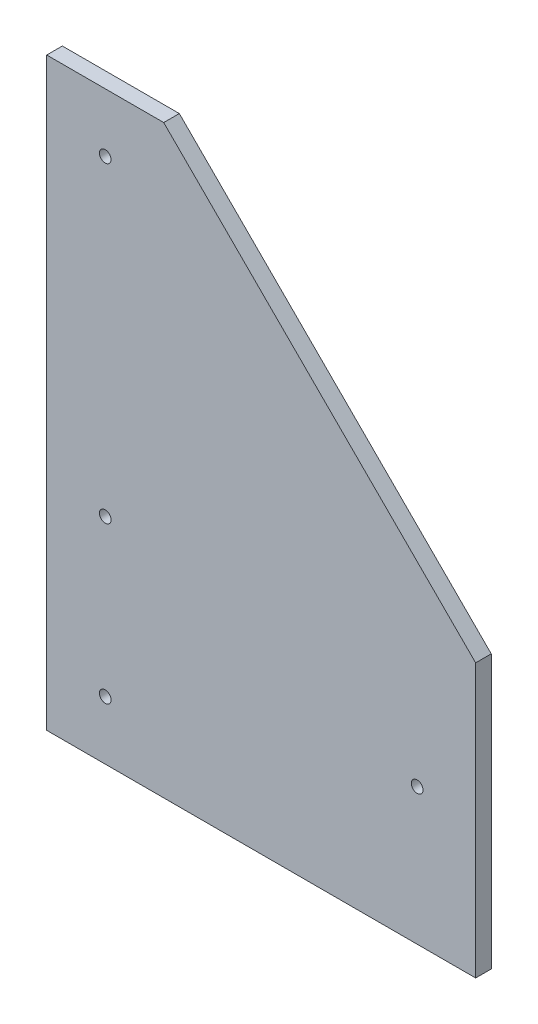
ISO-10303-21;
HEADER;
FILE_DESCRIPTION(('STEP AP214'),'2;1');
FILE_NAME('part.step','',(''),(''),'','','');
FILE_SCHEMA(('AUTOMOTIVE_DESIGN { 1 0 10303 214 1 1 1 1 }'));
ENDSEC;
DATA;
#1=APPLICATION_CONTEXT('core data for automotive mechanical design processes');
#2=APPLICATION_PROTOCOL_DEFINITION('international standard','automotive_design',2000,#1);
#3=PRODUCT_CONTEXT('',#1,'mechanical');
#4=PRODUCT('Part','Part','',(#3));
#5=PRODUCT_RELATED_PRODUCT_CATEGORY('part','',(#4));
#6=PRODUCT_DEFINITION_FORMATION('','',#4);
#7=PRODUCT_DEFINITION_CONTEXT('part definition',#1,'design');
#8=PRODUCT_DEFINITION('design','',#6,#7);
#9=PRODUCT_DEFINITION_SHAPE('','',#8);
#10=(LENGTH_UNIT() NAMED_UNIT(*) SI_UNIT(.MILLI.,.METRE.));
#11=(NAMED_UNIT(*) PLANE_ANGLE_UNIT() SI_UNIT($,.RADIAN.));
#12=(NAMED_UNIT(*) SI_UNIT($,.STERADIAN.) SOLID_ANGLE_UNIT());
#13=UNCERTAINTY_MEASURE_WITH_UNIT(LENGTH_MEASURE(1.E-05),#10,'distance_accuracy_value','');
#14=(GEOMETRIC_REPRESENTATION_CONTEXT(3) GLOBAL_UNCERTAINTY_ASSIGNED_CONTEXT((#13)) GLOBAL_UNIT_ASSIGNED_CONTEXT((#10,
#11,#12)) REPRESENTATION_CONTEXT('',''));
#15=CARTESIAN_POINT('',(0.,0.,0.));
#16=DIRECTION('',(0.,0.,1.));
#17=DIRECTION('',(1.,0.,0.));
#18=AXIS2_PLACEMENT_3D('',#15,#16,#17);
#19=CARTESIAN_POINT('',(0.,190.5,5.08));
#20=DIRECTION('',(1.,0.,0.));
#21=DIRECTION('',(0.,1.,0.));
#22=AXIS2_PLACEMENT_3D('',#19,#20,#21);
#23=PLANE('',#22);
#24=DIRECTION('',(0.,-1.,0.));
#25=VECTOR('',#24,1.);
#26=CARTESIAN_POINT('',(0.,190.5,0.));
#27=LINE('',#26,#25);
#28=CARTESIAN_POINT('',(0.,190.5,0.));
#29=VERTEX_POINT('',#28);
#30=CARTESIAN_POINT('',(0.,0.,0.));
#31=VERTEX_POINT('',#30);
#32=EDGE_CURVE('E107',#29,#31,#27,.T.);
#33=ORIENTED_EDGE('',*,*,#32,.T.);
#34=DIRECTION('',(0.,0.,-1.));
#35=VECTOR('',#34,1.);
#36=CARTESIAN_POINT('',(0.,0.,5.08));
#37=LINE('',#36,#35);
#38=CARTESIAN_POINT('',(0.,0.,5.08));
#39=VERTEX_POINT('',#38);
#40=EDGE_CURVE('E11',#39,#31,#37,.T.);
#41=ORIENTED_EDGE('',*,*,#40,.F.);
#42=DIRECTION('',(0.,-1.,0.));
#43=VECTOR('',#42,1.);
#44=CARTESIAN_POINT('',(0.,190.5,5.08));
#45=LINE('',#44,#43);
#46=CARTESIAN_POINT('',(0.,190.5,5.08));
#47=VERTEX_POINT('',#46);
#48=EDGE_CURVE('E116',#47,#39,#45,.T.);
#49=ORIENTED_EDGE('',*,*,#48,.F.);
#50=DIRECTION('',(0.,0.,-1.));
#51=VECTOR('',#50,1.);
#52=CARTESIAN_POINT('',(0.,190.5,5.08));
#53=LINE('',#52,#51);
#54=EDGE_CURVE('E103',#47,#29,#53,.T.);
#55=ORIENTED_EDGE('',*,*,#54,.T.);
#56=EDGE_LOOP('',(#33,#41,#49,#55));
#57=FACE_BOUND('',#56,.T.);
#58=ADVANCED_FACE('F33',(#57),#23,.F.);
#59=CARTESIAN_POINT('',(0.,0.,5.08));
#60=DIRECTION('',(0.,1.,0.));
#61=DIRECTION('',(0.,0.,1.));
#62=AXIS2_PLACEMENT_3D('',#59,#60,#61);
#63=PLANE('',#62);
#64=DIRECTION('',(1.,0.,0.));
#65=VECTOR('',#64,1.);
#66=CARTESIAN_POINT('',(0.,0.,0.));
#67=LINE('',#66,#65);
#68=CARTESIAN_POINT('',(139.7,0.,0.));
#69=VERTEX_POINT('',#68);
#70=EDGE_CURVE('E110',#31,#69,#67,.T.);
#71=ORIENTED_EDGE('',*,*,#70,.T.);
#72=DIRECTION('',(0.,0.,-1.));
#73=VECTOR('',#72,1.);
#74=CARTESIAN_POINT('',(139.7,0.,5.08));
#75=LINE('',#74,#73);
#76=CARTESIAN_POINT('',(139.7,0.,5.08));
#77=VERTEX_POINT('',#76);
#78=EDGE_CURVE('E41',#77,#69,#75,.T.);
#79=ORIENTED_EDGE('',*,*,#78,.F.);
#80=DIRECTION('',(1.,0.,0.));
#81=VECTOR('',#80,1.);
#82=CARTESIAN_POINT('',(0.,0.,5.08));
#83=LINE('',#82,#81);
#84=EDGE_CURVE('E83',#39,#77,#83,.T.);
#85=ORIENTED_EDGE('',*,*,#84,.F.);
#86=ORIENTED_EDGE('',*,*,#40,.T.);
#87=EDGE_LOOP('',(#71,#79,#85,#86));
#88=FACE_BOUND('',#87,.T.);
#89=ADVANCED_FACE('F136',(#88),#63,.F.);
#90=CARTESIAN_POINT('',(139.7,0.,5.08));
#91=DIRECTION('',(-1.,0.,0.));
#92=DIRECTION('',(0.,-1.,0.));
#93=AXIS2_PLACEMENT_3D('',#90,#91,#92);
#94=PLANE('',#93);
#95=DIRECTION('',(0.,1.,0.));
#96=VECTOR('',#95,1.);
#97=CARTESIAN_POINT('',(139.7,0.,0.));
#98=LINE('',#97,#96);
#99=CARTESIAN_POINT('',(139.7,88.9,0.));
#100=VERTEX_POINT('',#99);
#101=EDGE_CURVE('E98',#69,#100,#98,.T.);
#102=ORIENTED_EDGE('',*,*,#101,.T.);
#103=DIRECTION('',(0.,0.,-1.));
#104=VECTOR('',#103,1.);
#105=CARTESIAN_POINT('',(139.7,88.9,5.08));
#106=LINE('',#105,#104);
#107=CARTESIAN_POINT('',(139.7,88.9,5.08));
#108=VERTEX_POINT('',#107);
#109=EDGE_CURVE('E95',#108,#100,#106,.T.);
#110=ORIENTED_EDGE('',*,*,#109,.F.);
#111=DIRECTION('',(0.,1.,0.));
#112=VECTOR('',#111,1.);
#113=CARTESIAN_POINT('',(139.7,0.,5.08));
#114=LINE('',#113,#112);
#115=EDGE_CURVE('E87',#77,#108,#114,.T.);
#116=ORIENTED_EDGE('',*,*,#115,.F.);
#117=ORIENTED_EDGE('',*,*,#78,.T.);
#118=EDGE_LOOP('',(#102,#110,#116,#117));
#119=FACE_BOUND('',#118,.T.);
#120=ADVANCED_FACE('F96',(#119),#94,.F.);
#121=CARTESIAN_POINT('',(139.7,88.9,5.08));
#122=DIRECTION('',(-0.707106781186547,-0.707106781186548,0.));
#123=DIRECTION('',(0.707106781186548,-0.707106781186547,0.));
#124=AXIS2_PLACEMENT_3D('',#121,#122,#123);
#125=PLANE('',#124);
#126=DIRECTION('',(-0.707106781186548,0.707106781186547,0.));
#127=VECTOR('',#126,1.);
#128=CARTESIAN_POINT('',(139.7,88.9,0.));
#129=LINE('',#128,#127);
#130=CARTESIAN_POINT('',(38.1,190.5,0.));
#131=VERTEX_POINT('',#130);
#132=EDGE_CURVE('E69',#100,#131,#129,.T.);
#133=ORIENTED_EDGE('',*,*,#132,.T.);
#134=DIRECTION('',(0.,0.,-1.));
#135=VECTOR('',#134,1.);
#136=CARTESIAN_POINT('',(38.1,190.5,5.08));
#137=LINE('',#136,#135);
#138=CARTESIAN_POINT('',(38.1,190.5,5.08));
#139=VERTEX_POINT('',#138);
#140=EDGE_CURVE('E99',#139,#131,#137,.T.);
#141=ORIENTED_EDGE('',*,*,#140,.F.);
#142=DIRECTION('',(-0.707106781186548,0.707106781186547,0.));
#143=VECTOR('',#142,1.);
#144=CARTESIAN_POINT('',(139.7,88.9,5.08));
#145=LINE('',#144,#143);
#146=EDGE_CURVE('E91',#108,#139,#145,.T.);
#147=ORIENTED_EDGE('',*,*,#146,.F.);
#148=ORIENTED_EDGE('',*,*,#109,.T.);
#149=EDGE_LOOP('',(#133,#141,#147,#148));
#150=FACE_BOUND('',#149,.T.);
#151=ADVANCED_FACE('F101',(#150),#125,.F.);
#152=CARTESIAN_POINT('',(38.1,190.5,5.08));
#153=DIRECTION('',(0.,-1.,0.));
#154=DIRECTION('',(0.,0.,-1.));
#155=AXIS2_PLACEMENT_3D('',#152,#153,#154);
#156=PLANE('',#155);
#157=DIRECTION('',(-1.,0.,0.));
#158=VECTOR('',#157,1.);
#159=CARTESIAN_POINT('',(38.1,190.5,0.));
#160=LINE('',#159,#158);
#161=EDGE_CURVE('E75',#131,#29,#160,.T.);
#162=ORIENTED_EDGE('',*,*,#161,.T.);
#163=ORIENTED_EDGE('',*,*,#54,.F.);
#164=DIRECTION('',(-1.,0.,0.));
#165=VECTOR('',#164,1.);
#166=CARTESIAN_POINT('',(38.1,190.5,5.08));
#167=LINE('',#166,#165);
#168=EDGE_CURVE('E49',#139,#47,#167,.T.);
#169=ORIENTED_EDGE('',*,*,#168,.F.);
#170=ORIENTED_EDGE('',*,*,#140,.T.);
#171=EDGE_LOOP('',(#162,#163,#169,#170));
#172=FACE_BOUND('',#171,.T.);
#173=ADVANCED_FACE('F124',(#172),#156,.F.);
#174=CARTESIAN_POINT('',(0.,0.,5.08));
#175=DIRECTION('',(0.,0.,1.));
#176=DIRECTION('',(1.,0.,0.));
#177=AXIS2_PLACEMENT_3D('',#174,#175,#176);
#178=PLANE('',#177);
#179=CARTESIAN_POINT('',(19.05,171.45,5.08));
#180=DIRECTION('',(0.,0.,1.));
#181=DIRECTION('',(1.,0.,0.));
#182=AXIS2_PLACEMENT_3D('',#179,#180,#181);
#183=CIRCLE('',#182,1.89864999999999);
#184=CARTESIAN_POINT('',(20.9486499999999,171.45,5.08));
#185=VERTEX_POINT('',#184);
#186=EDGE_CURVE('E218',#185,#185,#183,.T.);
#187=ORIENTED_EDGE('',*,*,#186,.F.);
#188=EDGE_LOOP('',(#187));
#189=FACE_BOUND('',#188,.T.);
#190=CARTESIAN_POINT('',(19.05,19.05,5.08));
#191=DIRECTION('',(0.,0.,1.));
#192=DIRECTION('',(1.,0.,0.));
#193=AXIS2_PLACEMENT_3D('',#190,#191,#192);
#194=CIRCLE('',#193,1.89864999999999);
#195=CARTESIAN_POINT('',(20.94865,19.05,5.08));
#196=VERTEX_POINT('',#195);
#197=EDGE_CURVE('E220',#196,#196,#194,.T.);
#198=ORIENTED_EDGE('',*,*,#197,.F.);
#199=EDGE_LOOP('',(#198));
#200=FACE_BOUND('',#199,.T.);
#201=CARTESIAN_POINT('',(19.05,69.85,5.08));
#202=DIRECTION('',(0.,0.,1.));
#203=DIRECTION('',(1.,0.,0.));
#204=AXIS2_PLACEMENT_3D('',#201,#202,#203);
#205=CIRCLE('',#204,1.89864999999999);
#206=CARTESIAN_POINT('',(20.94865,69.85,5.08));
#207=VERTEX_POINT('',#206);
#208=EDGE_CURVE('E228',#207,#207,#205,.T.);
#209=ORIENTED_EDGE('',*,*,#208,.F.);
#210=EDGE_LOOP('',(#209));
#211=FACE_BOUND('',#210,.T.);
#212=CARTESIAN_POINT('',(120.65,44.45,5.08));
#213=DIRECTION('',(0.,0.,1.));
#214=DIRECTION('',(1.,0.,0.));
#215=AXIS2_PLACEMENT_3D('',#212,#213,#214);
#216=CIRCLE('',#215,1.89864999999999);
#217=CARTESIAN_POINT('',(122.54865,44.45,5.08));
#218=VERTEX_POINT('',#217);
#219=EDGE_CURVE('E234',#218,#218,#216,.T.);
#220=ORIENTED_EDGE('',*,*,#219,.F.);
#221=EDGE_LOOP('',(#220));
#222=FACE_BOUND('',#221,.T.);
#223=ORIENTED_EDGE('',*,*,#48,.T.);
#224=ORIENTED_EDGE('',*,*,#84,.T.);
#225=ORIENTED_EDGE('',*,*,#115,.T.);
#226=ORIENTED_EDGE('',*,*,#146,.T.);
#227=ORIENTED_EDGE('',*,*,#168,.T.);
#228=EDGE_LOOP('',(#223,#224,#225,#226,#227));
#229=FACE_BOUND('',#228,.T.);
#230=ADVANCED_FACE('F89',(#189,#200,#211,#222,#229),#178,.T.);
#231=CARTESIAN_POINT('',(0.,0.,0.));
#232=DIRECTION('',(0.,0.,1.));
#233=DIRECTION('',(1.,0.,0.));
#234=AXIS2_PLACEMENT_3D('',#231,#232,#233);
#235=PLANE('',#234);
#236=CARTESIAN_POINT('',(19.05,171.45,0.));
#237=DIRECTION('',(0.,0.,1.));
#238=DIRECTION('',(1.,0.,0.));
#239=AXIS2_PLACEMENT_3D('',#236,#237,#238);
#240=CIRCLE('',#239,1.89865);
#241=CARTESIAN_POINT('',(20.94865,171.45,0.));
#242=VERTEX_POINT('',#241);
#243=EDGE_CURVE('E215',#242,#242,#240,.T.);
#244=ORIENTED_EDGE('',*,*,#243,.T.);
#245=EDGE_LOOP('',(#244));
#246=FACE_BOUND('',#245,.T.);
#247=CARTESIAN_POINT('',(19.05,19.05,0.));
#248=DIRECTION('',(0.,0.,1.));
#249=DIRECTION('',(1.,0.,0.));
#250=AXIS2_PLACEMENT_3D('',#247,#248,#249);
#251=CIRCLE('',#250,1.89865);
#252=CARTESIAN_POINT('',(20.94865,19.05,0.));
#253=VERTEX_POINT('',#252);
#254=EDGE_CURVE('E225',#253,#253,#251,.T.);
#255=ORIENTED_EDGE('',*,*,#254,.T.);
#256=EDGE_LOOP('',(#255));
#257=FACE_BOUND('',#256,.T.);
#258=CARTESIAN_POINT('',(19.05,69.85,0.));
#259=DIRECTION('',(0.,0.,1.));
#260=DIRECTION('',(1.,0.,0.));
#261=AXIS2_PLACEMENT_3D('',#258,#259,#260);
#262=CIRCLE('',#261,1.89865);
#263=CARTESIAN_POINT('',(20.94865,69.85,0.));
#264=VERTEX_POINT('',#263);
#265=EDGE_CURVE('E231',#264,#264,#262,.T.);
#266=ORIENTED_EDGE('',*,*,#265,.T.);
#267=EDGE_LOOP('',(#266));
#268=FACE_BOUND('',#267,.T.);
#269=CARTESIAN_POINT('',(120.65,44.45,0.));
#270=DIRECTION('',(0.,0.,1.));
#271=DIRECTION('',(1.,0.,0.));
#272=AXIS2_PLACEMENT_3D('',#269,#270,#271);
#273=CIRCLE('',#272,1.89865);
#274=CARTESIAN_POINT('',(122.54865,44.45,0.));
#275=VERTEX_POINT('',#274);
#276=EDGE_CURVE('E111',#275,#275,#273,.T.);
#277=ORIENTED_EDGE('',*,*,#276,.T.);
#278=EDGE_LOOP('',(#277));
#279=FACE_BOUND('',#278,.T.);
#280=ORIENTED_EDGE('',*,*,#32,.F.);
#281=ORIENTED_EDGE('',*,*,#161,.F.);
#282=ORIENTED_EDGE('',*,*,#132,.F.);
#283=ORIENTED_EDGE('',*,*,#101,.F.);
#284=ORIENTED_EDGE('',*,*,#70,.F.);
#285=EDGE_LOOP('',(#280,#281,#282,#283,#284));
#286=FACE_BOUND('',#285,.T.);
#287=ADVANCED_FACE('F120',(#246,#257,#268,#279,#286),#235,.F.);
#288=CARTESIAN_POINT('',(120.65,44.45,5.08));
#289=DIRECTION('',(0.,0.,1.));
#290=DIRECTION('',(1.,0.,0.));
#291=AXIS2_PLACEMENT_3D('',#288,#289,#290);
#292=CYLINDRICAL_SURFACE('',#291,1.89864999999999);
#293=ORIENTED_EDGE('',*,*,#276,.F.);
#294=EDGE_LOOP('',(#293));
#295=FACE_BOUND('',#294,.T.);
#296=ORIENTED_EDGE('',*,*,#219,.T.);
#297=EDGE_LOOP('',(#296));
#298=FACE_BOUND('',#297,.T.);
#299=ADVANCED_FACE('F169',(#295,#298),#292,.F.);
#300=CARTESIAN_POINT('',(19.05,69.85,5.08));
#301=DIRECTION('',(0.,0.,1.));
#302=DIRECTION('',(1.,0.,0.));
#303=AXIS2_PLACEMENT_3D('',#300,#301,#302);
#304=CYLINDRICAL_SURFACE('',#303,1.89864999999999);
#305=ORIENTED_EDGE('',*,*,#265,.F.);
#306=EDGE_LOOP('',(#305));
#307=FACE_BOUND('',#306,.T.);
#308=ORIENTED_EDGE('',*,*,#208,.T.);
#309=EDGE_LOOP('',(#308));
#310=FACE_BOUND('',#309,.T.);
#311=ADVANCED_FACE('F178',(#307,#310),#304,.F.);
#312=CARTESIAN_POINT('',(19.05,19.05,5.08));
#313=DIRECTION('',(0.,0.,1.));
#314=DIRECTION('',(1.,0.,0.));
#315=AXIS2_PLACEMENT_3D('',#312,#313,#314);
#316=CYLINDRICAL_SURFACE('',#315,1.89864999999999);
#317=ORIENTED_EDGE('',*,*,#254,.F.);
#318=EDGE_LOOP('',(#317));
#319=FACE_BOUND('',#318,.T.);
#320=ORIENTED_EDGE('',*,*,#197,.T.);
#321=EDGE_LOOP('',(#320));
#322=FACE_BOUND('',#321,.T.);
#323=ADVANCED_FACE('F188',(#319,#322),#316,.F.);
#324=CARTESIAN_POINT('',(19.05,171.45,5.08));
#325=DIRECTION('',(0.,0.,1.));
#326=DIRECTION('',(1.,0.,0.));
#327=AXIS2_PLACEMENT_3D('',#324,#325,#326);
#328=CYLINDRICAL_SURFACE('',#327,1.89864999999999);
#329=ORIENTED_EDGE('',*,*,#243,.F.);
#330=EDGE_LOOP('',(#329));
#331=FACE_BOUND('',#330,.T.);
#332=ORIENTED_EDGE('',*,*,#186,.T.);
#333=EDGE_LOOP('',(#332));
#334=FACE_BOUND('',#333,.T.);
#335=ADVANCED_FACE('F198',(#331,#334),#328,.F.);
#336=CLOSED_SHELL('',(#58,#89,#120,#151,#173,#230,#287,#299,#311,#323,#335));
#337=MANIFOLD_SOLID_BREP('B2',#336);
#338=ADVANCED_BREP_SHAPE_REPRESENTATION('',(#18,#337),#14);
#339=SHAPE_DEFINITION_REPRESENTATION(#9,#338);
ENDSEC;
END-ISO-10303-21;
